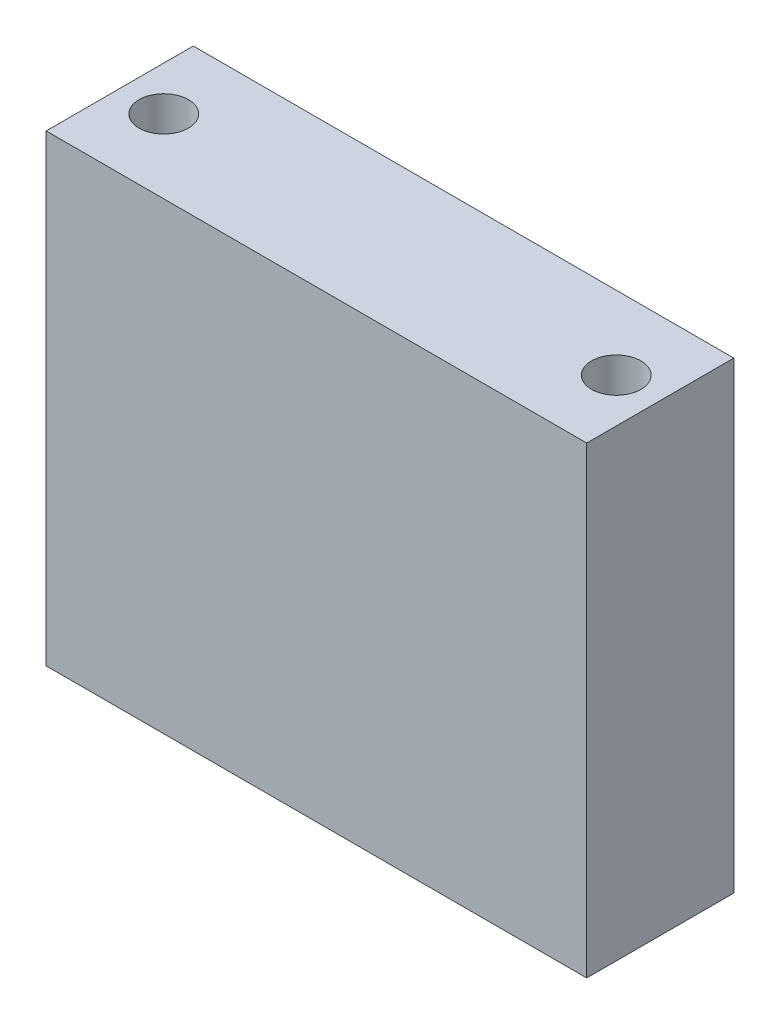
ISO-10303-21;
HEADER;
FILE_DESCRIPTION(('STEP AP214'),'2;1');
FILE_NAME('part.step','',(''),(''),'','','');
FILE_SCHEMA(('AUTOMOTIVE_DESIGN { 1 0 10303 214 1 1 1 1 }'));
ENDSEC;
DATA;
#1=APPLICATION_CONTEXT('core data for automotive mechanical design processes');
#2=APPLICATION_PROTOCOL_DEFINITION('international standard','automotive_design',2000,#1);
#3=PRODUCT_CONTEXT('',#1,'mechanical');
#4=PRODUCT('Part','Part','',(#3));
#5=PRODUCT_RELATED_PRODUCT_CATEGORY('part','',(#4));
#6=PRODUCT_DEFINITION_FORMATION('','',#4);
#7=PRODUCT_DEFINITION_CONTEXT('part definition',#1,'design');
#8=PRODUCT_DEFINITION('design','',#6,#7);
#9=PRODUCT_DEFINITION_SHAPE('','',#8);
#10=(LENGTH_UNIT() NAMED_UNIT(*) SI_UNIT(.MILLI.,.METRE.));
#11=(NAMED_UNIT(*) PLANE_ANGLE_UNIT() SI_UNIT($,.RADIAN.));
#12=(NAMED_UNIT(*) SI_UNIT($,.STERADIAN.) SOLID_ANGLE_UNIT());
#13=UNCERTAINTY_MEASURE_WITH_UNIT(LENGTH_MEASURE(1.E-05),#10,'distance_accuracy_value','');
#14=(GEOMETRIC_REPRESENTATION_CONTEXT(3) GLOBAL_UNCERTAINTY_ASSIGNED_CONTEXT((#13)) GLOBAL_UNIT_ASSIGNED_CONTEXT((#10,
#11,#12)) REPRESENTATION_CONTEXT('',''));
#15=CARTESIAN_POINT('',(0.,0.,0.));
#16=DIRECTION('',(0.,0.,1.));
#17=DIRECTION('',(1.,0.,0.));
#18=AXIS2_PLACEMENT_3D('',#15,#16,#17);
#19=CARTESIAN_POINT('',(17.5,30.,-4.7625));
#20=DIRECTION('',(0.,0.,1.));
#21=DIRECTION('',(1.,0.,0.));
#22=AXIS2_PLACEMENT_3D('',#19,#20,#21);
#23=PLANE('',#22);
#24=DIRECTION('',(-1.,0.,0.));
#25=VECTOR('',#24,1.);
#26=CARTESIAN_POINT('',(17.5,0.,-4.7625));
#27=LINE('',#26,#25);
#28=CARTESIAN_POINT('',(17.5,0.,-4.7625));
#29=VERTEX_POINT('',#28);
#30=CARTESIAN_POINT('',(-17.5,0.,-4.7625));
#31=VERTEX_POINT('',#30);
#32=EDGE_CURVE('E100',#29,#31,#27,.T.);
#33=ORIENTED_EDGE('',*,*,#32,.T.);
#34=DIRECTION('',(0.,-1.,0.));
#35=VECTOR('',#34,1.);
#36=CARTESIAN_POINT('',(-17.5,30.,-4.7625));
#37=LINE('',#36,#35);
#38=CARTESIAN_POINT('',(-17.5,30.,-4.7625));
#39=VERTEX_POINT('',#38);
#40=EDGE_CURVE('E11',#39,#31,#37,.T.);
#41=ORIENTED_EDGE('',*,*,#40,.F.);
#42=DIRECTION('',(-1.,0.,0.));
#43=VECTOR('',#42,1.);
#44=CARTESIAN_POINT('',(17.5,30.,-4.7625));
#45=LINE('',#44,#43);
#46=CARTESIAN_POINT('',(17.5,30.,-4.7625));
#47=VERTEX_POINT('',#46);
#48=EDGE_CURVE('E88',#47,#39,#45,.T.);
#49=ORIENTED_EDGE('',*,*,#48,.F.);
#50=DIRECTION('',(0.,-1.,0.));
#51=VECTOR('',#50,1.);
#52=CARTESIAN_POINT('',(17.5,30.,-4.7625));
#53=LINE('',#52,#51);
#54=EDGE_CURVE('E96',#47,#29,#53,.T.);
#55=ORIENTED_EDGE('',*,*,#54,.T.);
#56=EDGE_LOOP('',(#33,#41,#49,#55));
#57=FACE_BOUND('',#56,.T.);
#58=ADVANCED_FACE('F37',(#57),#23,.F.);
#59=CARTESIAN_POINT('',(-17.5,30.,-4.7625));
#60=DIRECTION('',(1.,0.,0.));
#61=DIRECTION('',(0.,0.,-1.));
#62=AXIS2_PLACEMENT_3D('',#59,#60,#61);
#63=PLANE('',#62);
#64=DIRECTION('',(0.,0.,1.));
#65=VECTOR('',#64,1.);
#66=CARTESIAN_POINT('',(-17.5,0.,-4.7625));
#67=LINE('',#66,#65);
#68=CARTESIAN_POINT('',(-17.5,0.,4.7625));
#69=VERTEX_POINT('',#68);
#70=EDGE_CURVE('E92',#31,#69,#67,.T.);
#71=ORIENTED_EDGE('',*,*,#70,.T.);
#72=DIRECTION('',(0.,-1.,0.));
#73=VECTOR('',#72,1.);
#74=CARTESIAN_POINT('',(-17.5,30.,4.7625));
#75=LINE('',#74,#73);
#76=CARTESIAN_POINT('',(-17.5,30.,4.7625));
#77=VERTEX_POINT('',#76);
#78=EDGE_CURVE('E45',#77,#69,#75,.T.);
#79=ORIENTED_EDGE('',*,*,#78,.F.);
#80=DIRECTION('',(0.,0.,1.));
#81=VECTOR('',#80,1.);
#82=CARTESIAN_POINT('',(-17.5,30.,-4.7625));
#83=LINE('',#82,#81);
#84=EDGE_CURVE('E83',#39,#77,#83,.T.);
#85=ORIENTED_EDGE('',*,*,#84,.F.);
#86=ORIENTED_EDGE('',*,*,#40,.T.);
#87=EDGE_LOOP('',(#71,#79,#85,#86));
#88=FACE_BOUND('',#87,.T.);
#89=ADVANCED_FACE('F91',(#88),#63,.F.);
#90=CARTESIAN_POINT('',(-17.5,30.,4.7625));
#91=DIRECTION('',(0.,0.,-1.));
#92=DIRECTION('',(-1.,0.,0.));
#93=AXIS2_PLACEMENT_3D('',#90,#91,#92);
#94=PLANE('',#93);
#95=DIRECTION('',(1.,0.,0.));
#96=VECTOR('',#95,1.);
#97=CARTESIAN_POINT('',(-17.5,0.,4.7625));
#98=LINE('',#97,#96);
#99=CARTESIAN_POINT('',(17.5,0.,4.7625));
#100=VERTEX_POINT('',#99);
#101=EDGE_CURVE('E70',#69,#100,#98,.T.);
#102=ORIENTED_EDGE('',*,*,#101,.T.);
#103=DIRECTION('',(0.,-1.,0.));
#104=VECTOR('',#103,1.);
#105=CARTESIAN_POINT('',(17.5,30.,4.7625));
#106=LINE('',#105,#104);
#107=CARTESIAN_POINT('',(17.5,30.,4.7625));
#108=VERTEX_POINT('',#107);
#109=EDGE_CURVE('E93',#108,#100,#106,.T.);
#110=ORIENTED_EDGE('',*,*,#109,.F.);
#111=DIRECTION('',(1.,0.,0.));
#112=VECTOR('',#111,1.);
#113=CARTESIAN_POINT('',(-17.5,30.,4.7625));
#114=LINE('',#113,#112);
#115=EDGE_CURVE('E86',#77,#108,#114,.T.);
#116=ORIENTED_EDGE('',*,*,#115,.F.);
#117=ORIENTED_EDGE('',*,*,#78,.T.);
#118=EDGE_LOOP('',(#102,#110,#116,#117));
#119=FACE_BOUND('',#118,.T.);
#120=ADVANCED_FACE('F94',(#119),#94,.F.);
#121=CARTESIAN_POINT('',(17.5,30.,4.7625));
#122=DIRECTION('',(-1.,0.,0.));
#123=DIRECTION('',(0.,0.,1.));
#124=AXIS2_PLACEMENT_3D('',#121,#122,#123);
#125=PLANE('',#124);
#126=DIRECTION('',(0.,0.,-1.));
#127=VECTOR('',#126,1.);
#128=CARTESIAN_POINT('',(17.5,0.,4.7625));
#129=LINE('',#128,#127);
#130=EDGE_CURVE('E76',#100,#29,#129,.T.);
#131=ORIENTED_EDGE('',*,*,#130,.T.);
#132=ORIENTED_EDGE('',*,*,#54,.F.);
#133=DIRECTION('',(0.,0.,-1.));
#134=VECTOR('',#133,1.);
#135=CARTESIAN_POINT('',(17.5,30.,4.7625));
#136=LINE('',#135,#134);
#137=EDGE_CURVE('E53',#108,#47,#136,.T.);
#138=ORIENTED_EDGE('',*,*,#137,.F.);
#139=ORIENTED_EDGE('',*,*,#109,.T.);
#140=EDGE_LOOP('',(#131,#132,#138,#139));
#141=FACE_BOUND('',#140,.T.);
#142=ADVANCED_FACE('F108',(#141),#125,.F.);
#143=CARTESIAN_POINT('',(0.,30.,0.));
#144=DIRECTION('',(0.,1.,0.));
#145=DIRECTION('',(0.,0.,1.));
#146=AXIS2_PLACEMENT_3D('',#143,#144,#145);
#147=PLANE('',#146);
#148=CARTESIAN_POINT('',(14.65,30.,0.));
#149=DIRECTION('',(0.,1.,0.));
#150=DIRECTION('',(0.,0.,1.));
#151=AXIS2_PLACEMENT_3D('',#148,#149,#150);
#152=CIRCLE('',#151,1.6);
#153=CARTESIAN_POINT('',(14.65,30.,1.6));
#154=VERTEX_POINT('',#153);
#155=EDGE_CURVE('E122',#154,#154,#152,.T.);
#156=ORIENTED_EDGE('',*,*,#155,.F.);
#157=EDGE_LOOP('',(#156));
#158=FACE_BOUND('',#157,.T.);
#159=CARTESIAN_POINT('',(-14.65,30.,0.));
#160=DIRECTION('',(0.,1.,0.));
#161=DIRECTION('',(0.,0.,1.));
#162=AXIS2_PLACEMENT_3D('',#159,#160,#161);
#163=CIRCLE('',#162,1.6);
#164=CARTESIAN_POINT('',(-14.65,30.,1.6));
#165=VERTEX_POINT('',#164);
#166=EDGE_CURVE('E116',#165,#165,#163,.T.);
#167=ORIENTED_EDGE('',*,*,#166,.F.);
#168=EDGE_LOOP('',(#167));
#169=FACE_BOUND('',#168,.T.);
#170=ORIENTED_EDGE('',*,*,#48,.T.);
#171=ORIENTED_EDGE('',*,*,#84,.T.);
#172=ORIENTED_EDGE('',*,*,#115,.T.);
#173=ORIENTED_EDGE('',*,*,#137,.T.);
#174=EDGE_LOOP('',(#170,#171,#172,#173));
#175=FACE_BOUND('',#174,.T.);
#176=ADVANCED_FACE('F84',(#158,#169,#175),#147,.T.);
#177=CARTESIAN_POINT('',(0.,0.,0.));
#178=DIRECTION('',(0.,1.,0.));
#179=DIRECTION('',(0.,0.,1.));
#180=AXIS2_PLACEMENT_3D('',#177,#178,#179);
#181=PLANE('',#180);
#182=CARTESIAN_POINT('',(14.65,0.,0.));
#183=DIRECTION('',(0.,1.,0.));
#184=DIRECTION('',(0.,0.,1.));
#185=AXIS2_PLACEMENT_3D('',#182,#183,#184);
#186=CIRCLE('',#185,1.59999999999999);
#187=CARTESIAN_POINT('',(14.65,0.,1.59999999999999));
#188=VERTEX_POINT('',#187);
#189=EDGE_CURVE('E119',#188,#188,#186,.T.);
#190=ORIENTED_EDGE('',*,*,#189,.T.);
#191=EDGE_LOOP('',(#190));
#192=FACE_BOUND('',#191,.T.);
#193=CARTESIAN_POINT('',(-14.65,0.,0.));
#194=DIRECTION('',(0.,1.,0.));
#195=DIRECTION('',(0.,0.,1.));
#196=AXIS2_PLACEMENT_3D('',#193,#194,#195);
#197=CIRCLE('',#196,1.59999999999999);
#198=CARTESIAN_POINT('',(-14.65,0.,1.59999999999999));
#199=VERTEX_POINT('',#198);
#200=EDGE_CURVE('E103',#199,#199,#197,.T.);
#201=ORIENTED_EDGE('',*,*,#200,.T.);
#202=EDGE_LOOP('',(#201));
#203=FACE_BOUND('',#202,.T.);
#204=ORIENTED_EDGE('',*,*,#32,.F.);
#205=ORIENTED_EDGE('',*,*,#130,.F.);
#206=ORIENTED_EDGE('',*,*,#101,.F.);
#207=ORIENTED_EDGE('',*,*,#70,.F.);
#208=EDGE_LOOP('',(#204,#205,#206,#207));
#209=FACE_BOUND('',#208,.T.);
#210=ADVANCED_FACE('F111',(#192,#203,#209),#181,.F.);
#211=CARTESIAN_POINT('',(-14.65,30.,0.));
#212=DIRECTION('',(0.,1.,0.));
#213=DIRECTION('',(0.,0.,1.));
#214=AXIS2_PLACEMENT_3D('',#211,#212,#213);
#215=CYLINDRICAL_SURFACE('',#214,1.6);
#216=ORIENTED_EDGE('',*,*,#200,.F.);
#217=EDGE_LOOP('',(#216));
#218=FACE_BOUND('',#217,.T.);
#219=ORIENTED_EDGE('',*,*,#166,.T.);
#220=EDGE_LOOP('',(#219));
#221=FACE_BOUND('',#220,.T.);
#222=ADVANCED_FACE('F133',(#218,#221),#215,.F.);
#223=CARTESIAN_POINT('',(14.65,30.,0.));
#224=DIRECTION('',(0.,1.,0.));
#225=DIRECTION('',(0.,0.,1.));
#226=AXIS2_PLACEMENT_3D('',#223,#224,#225);
#227=CYLINDRICAL_SURFACE('',#226,1.6);
#228=ORIENTED_EDGE('',*,*,#189,.F.);
#229=EDGE_LOOP('',(#228));
#230=FACE_BOUND('',#229,.T.);
#231=ORIENTED_EDGE('',*,*,#155,.T.);
#232=EDGE_LOOP('',(#231));
#233=FACE_BOUND('',#232,.T.);
#234=ADVANCED_FACE('F126',(#230,#233),#227,.F.);
#235=CLOSED_SHELL('',(#58,#89,#120,#142,#176,#210,#222,#234));
#236=MANIFOLD_SOLID_BREP('B2',#235);
#237=ADVANCED_BREP_SHAPE_REPRESENTATION('',(#18,#236),#14);
#238=SHAPE_DEFINITION_REPRESENTATION(#9,#237);
ENDSEC;
END-ISO-10303-21;
